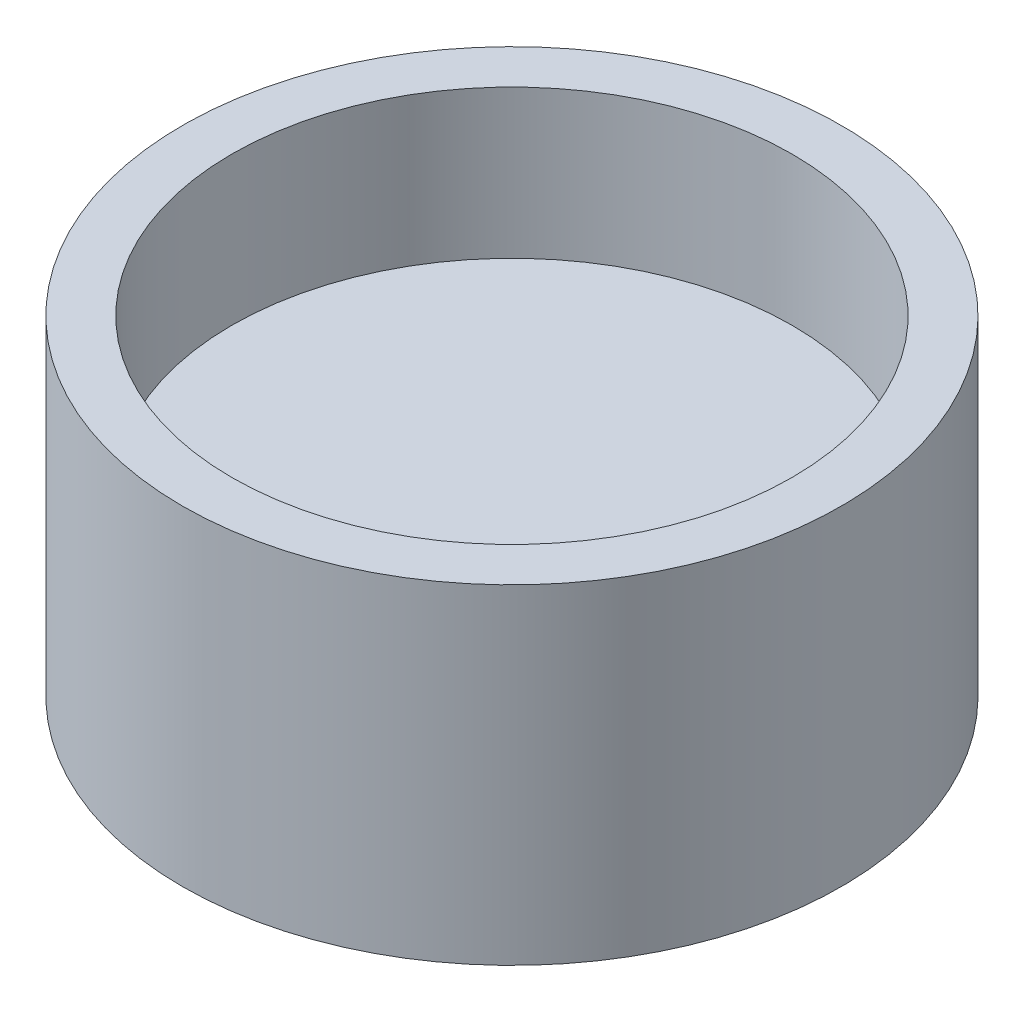
ISO-10303-21;
HEADER;
FILE_DESCRIPTION(('STEP AP214'),'2;1');
FILE_NAME('part.step','',(''),(''),'','','');
FILE_SCHEMA(('AUTOMOTIVE_DESIGN { 1 0 10303 214 1 1 1 1 }'));
ENDSEC;
DATA;
#1=APPLICATION_CONTEXT('core data for automotive mechanical design processes');
#2=APPLICATION_PROTOCOL_DEFINITION('international standard','automotive_design',2000,#1);
#3=PRODUCT_CONTEXT('',#1,'mechanical');
#4=PRODUCT('Part','Part','',(#3));
#5=PRODUCT_RELATED_PRODUCT_CATEGORY('part','',(#4));
#6=PRODUCT_DEFINITION_FORMATION('','',#4);
#7=PRODUCT_DEFINITION_CONTEXT('part definition',#1,'design');
#8=PRODUCT_DEFINITION('design','',#6,#7);
#9=PRODUCT_DEFINITION_SHAPE('','',#8);
#10=(LENGTH_UNIT() NAMED_UNIT(*) SI_UNIT(.MILLI.,.METRE.));
#11=(NAMED_UNIT(*) PLANE_ANGLE_UNIT() SI_UNIT($,.RADIAN.));
#12=(NAMED_UNIT(*) SI_UNIT($,.STERADIAN.) SOLID_ANGLE_UNIT());
#13=UNCERTAINTY_MEASURE_WITH_UNIT(LENGTH_MEASURE(1.E-05),#10,'distance_accuracy_value','');
#14=(GEOMETRIC_REPRESENTATION_CONTEXT(3) GLOBAL_UNCERTAINTY_ASSIGNED_CONTEXT((#13)) GLOBAL_UNIT_ASSIGNED_CONTEXT((#10,
#11,#12)) REPRESENTATION_CONTEXT('',''));
#15=CARTESIAN_POINT('',(0.,0.,0.));
#16=DIRECTION('',(0.,0.,1.));
#17=DIRECTION('',(1.,0.,0.));
#18=AXIS2_PLACEMENT_3D('',#15,#16,#17);
#19=CARTESIAN_POINT('',(0.,4.,0.));
#20=DIRECTION('',(0.,-1.,0.));
#21=DIRECTION('',(0.,0.,-1.));
#22=AXIS2_PLACEMENT_3D('',#19,#20,#21);
#23=CYLINDRICAL_SURFACE('',#22,4.);
#24=CARTESIAN_POINT('',(0.,4.,0.));
#25=DIRECTION('',(0.,1.,0.));
#26=DIRECTION('',(0.,0.,1.));
#27=AXIS2_PLACEMENT_3D('',#24,#25,#26);
#28=CIRCLE('',#27,4.);
#29=CARTESIAN_POINT('',(0.,4.,4.));
#30=VERTEX_POINT('',#29);
#31=EDGE_CURVE('E10',#30,#30,#28,.T.);
#32=ORIENTED_EDGE('',*,*,#31,.F.);
#33=EDGE_LOOP('',(#32));
#34=FACE_BOUND('',#33,.T.);
#35=CARTESIAN_POINT('',(0.,0.,0.));
#36=DIRECTION('',(0.,1.,0.));
#37=DIRECTION('',(0.,0.,1.));
#38=AXIS2_PLACEMENT_3D('',#35,#36,#37);
#39=CIRCLE('',#38,4.);
#40=CARTESIAN_POINT('',(0.,0.,4.));
#41=VERTEX_POINT('',#40);
#42=EDGE_CURVE('E40',#41,#41,#39,.T.);
#43=ORIENTED_EDGE('',*,*,#42,.T.);
#44=EDGE_LOOP('',(#43));
#45=FACE_BOUND('',#44,.T.);
#46=ADVANCED_FACE('F37',(#34,#45),#23,.T.);
#47=CARTESIAN_POINT('',(0.,4.,0.));
#48=DIRECTION('',(0.,1.,0.));
#49=DIRECTION('',(0.,0.,1.));
#50=AXIS2_PLACEMENT_3D('',#47,#48,#49);
#51=PLANE('',#50);
#52=CARTESIAN_POINT('',(0.,4.,0.));
#53=DIRECTION('',(0.,1.,0.));
#54=DIRECTION('',(0.,0.,1.));
#55=AXIS2_PLACEMENT_3D('',#52,#53,#54);
#56=CIRCLE('',#55,3.4);
#57=CARTESIAN_POINT('',(0.,4.,3.4));
#58=VERTEX_POINT('',#57);
#59=EDGE_CURVE('E51',#58,#58,#56,.T.);
#60=ORIENTED_EDGE('',*,*,#59,.F.);
#61=EDGE_LOOP('',(#60));
#62=FACE_BOUND('',#61,.T.);
#63=ORIENTED_EDGE('',*,*,#31,.T.);
#64=EDGE_LOOP('',(#63));
#65=FACE_BOUND('',#64,.T.);
#66=ADVANCED_FACE('F68',(#62,#65),#51,.T.);
#67=CARTESIAN_POINT('',(0.,0.,0.));
#68=DIRECTION('',(0.,1.,0.));
#69=DIRECTION('',(0.,0.,1.));
#70=AXIS2_PLACEMENT_3D('',#67,#68,#69);
#71=PLANE('',#70);
#72=ORIENTED_EDGE('',*,*,#42,.F.);
#73=EDGE_LOOP('',(#72));
#74=FACE_BOUND('',#73,.T.);
#75=ADVANCED_FACE('F64',(#74),#71,.F.);
#76=CARTESIAN_POINT('',(0.,2.2,0.));
#77=DIRECTION('',(0.,1.,0.));
#78=DIRECTION('',(0.,0.,1.));
#79=AXIS2_PLACEMENT_3D('',#76,#77,#78);
#80=CYLINDRICAL_SURFACE('',#79,3.4);
#81=CARTESIAN_POINT('',(0.,2.2,0.));
#82=DIRECTION('',(0.,1.,0.));
#83=DIRECTION('',(0.,0.,1.));
#84=AXIS2_PLACEMENT_3D('',#81,#82,#83);
#85=CIRCLE('',#84,3.4);
#86=CARTESIAN_POINT('',(0.,2.2,3.4));
#87=VERTEX_POINT('',#86);
#88=EDGE_CURVE('E49',#87,#87,#85,.T.);
#89=ORIENTED_EDGE('',*,*,#88,.F.);
#90=EDGE_LOOP('',(#89));
#91=FACE_BOUND('',#90,.T.);
#92=ORIENTED_EDGE('',*,*,#59,.T.);
#93=EDGE_LOOP('',(#92));
#94=FACE_BOUND('',#93,.T.);
#95=ADVANCED_FACE('F61',(#91,#94),#80,.F.);
#96=CARTESIAN_POINT('',(0.,2.2,0.));
#97=DIRECTION('',(0.,1.,0.));
#98=DIRECTION('',(0.,0.,1.));
#99=AXIS2_PLACEMENT_3D('',#96,#97,#98);
#100=PLANE('',#99);
#101=ORIENTED_EDGE('',*,*,#88,.T.);
#102=EDGE_LOOP('',(#101));
#103=FACE_BOUND('',#102,.T.);
#104=ADVANCED_FACE('F59',(#103),#100,.T.);
#105=CLOSED_SHELL('',(#46,#66,#75,#95,#104));
#106=MANIFOLD_SOLID_BREP('B2',#105);
#107=ADVANCED_BREP_SHAPE_REPRESENTATION('',(#18,#106),#14);
#108=SHAPE_DEFINITION_REPRESENTATION(#9,#107);
ENDSEC;
END-ISO-10303-21;
